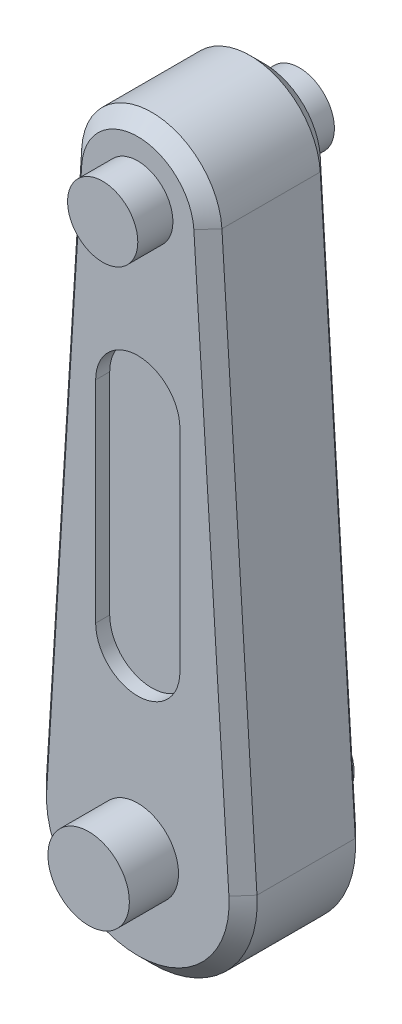
ISO-10303-21;
HEADER;
FILE_DESCRIPTION(('STEP AP214'),'2;1');
FILE_NAME('part.step','',(''),(''),'','','');
FILE_SCHEMA(('AUTOMOTIVE_DESIGN { 1 0 10303 214 1 1 1 1 }'));
ENDSEC;
DATA;
#1=APPLICATION_CONTEXT('core data for automotive mechanical design processes');
#2=APPLICATION_PROTOCOL_DEFINITION('international standard','automotive_design',2000,#1);
#3=PRODUCT_CONTEXT('',#1,'mechanical');
#4=PRODUCT('Part','Part','',(#3));
#5=PRODUCT_RELATED_PRODUCT_CATEGORY('part','',(#4));
#6=PRODUCT_DEFINITION_FORMATION('','',#4);
#7=PRODUCT_DEFINITION_CONTEXT('part definition',#1,'design');
#8=PRODUCT_DEFINITION('design','',#6,#7);
#9=PRODUCT_DEFINITION_SHAPE('','',#8);
#10=(LENGTH_UNIT() NAMED_UNIT(*) SI_UNIT(.MILLI.,.METRE.));
#11=(NAMED_UNIT(*) PLANE_ANGLE_UNIT() SI_UNIT($,.RADIAN.));
#12=(NAMED_UNIT(*) SI_UNIT($,.STERADIAN.) SOLID_ANGLE_UNIT());
#13=UNCERTAINTY_MEASURE_WITH_UNIT(LENGTH_MEASURE(1.E-05),#10,'distance_accuracy_value','');
#14=(GEOMETRIC_REPRESENTATION_CONTEXT(3) GLOBAL_UNCERTAINTY_ASSIGNED_CONTEXT((#13)) GLOBAL_UNIT_ASSIGNED_CONTEXT((#10,
#11,#12)) REPRESENTATION_CONTEXT('',''));
#15=CARTESIAN_POINT('',(0.,0.,0.));
#16=DIRECTION('',(0.,0.,1.));
#17=DIRECTION('',(1.,0.,0.));
#18=AXIS2_PLACEMENT_3D('',#15,#16,#17);
#19=CARTESIAN_POINT('',(0.,0.,-45.));
#20=DIRECTION('',(0.,0.,1.));
#21=DIRECTION('',(1.,0.,0.));
#22=AXIS2_PLACEMENT_3D('',#19,#20,#21);
#23=PLANE('',#22);
#24=CARTESIAN_POINT('',(0.,0.,-45.));
#25=DIRECTION('',(0.,0.,1.));
#26=DIRECTION('',(1.,0.,0.));
#27=AXIS2_PLACEMENT_3D('',#24,#25,#26);
#28=CIRCLE('',#27,29.);
#29=CARTESIAN_POINT('',(29.,0.,-45.));
#30=VERTEX_POINT('',#29);
#31=EDGE_CURVE('E248',#30,#30,#28,.F.);
#32=ORIENTED_EDGE('',*,*,#31,.F.);
#33=EDGE_LOOP('',(#32));
#34=FACE_BOUND('',#33,.T.);
#35=CARTESIAN_POINT('',(0.,400.,-45.));
#36=DIRECTION('',(0.,0.,1.));
#37=DIRECTION('',(1.,0.,0.));
#38=AXIS2_PLACEMENT_3D('',#35,#36,#37);
#39=CIRCLE('',#38,25.);
#40=CARTESIAN_POINT('',(25.,400.,-45.));
#41=VERTEX_POINT('',#40);
#42=EDGE_CURVE('E260',#41,#41,#39,.F.);
#43=ORIENTED_EDGE('',*,*,#42,.F.);
#44=EDGE_LOOP('',(#43));
#45=FACE_BOUND('',#44,.T.);
#46=CARTESIAN_POINT('',(0.,0.,-45.));
#47=DIRECTION('',(0.,0.,1.));
#48=DIRECTION('',(1.,0.,0.));
#49=AXIS2_PLACEMENT_3D('',#46,#47,#48);
#50=CIRCLE('',#49,65.);
#51=CARTESIAN_POINT('',(64.8729226546022,4.0625,-45.));
#52=VERTEX_POINT('',#51);
#53=CARTESIAN_POINT('',(-64.8729226546022,4.0625,-45.));
#54=VERTEX_POINT('',#53);
#55=EDGE_CURVE('E51',#52,#54,#50,.F.);
#56=ORIENTED_EDGE('',*,*,#55,.T.);
#57=DIRECTION('',(0.0625,0.998044963916957,0.));
#58=VECTOR('',#57,1.);
#59=CARTESIAN_POINT('',(-64.8729226546022,4.0625,-45.));
#60=LINE('',#59,#58);
#61=CARTESIAN_POINT('',(-39.9217985566783,402.5,-45.));
#62=VERTEX_POINT('',#61);
#63=EDGE_CURVE('E11',#54,#62,#60,.T.);
#64=ORIENTED_EDGE('',*,*,#63,.T.);
#65=CARTESIAN_POINT('',(0.,400.,-45.));
#66=DIRECTION('',(0.,0.,1.));
#67=DIRECTION('',(1.,0.,0.));
#68=AXIS2_PLACEMENT_3D('',#65,#66,#67);
#69=CIRCLE('',#68,40.);
#70=CARTESIAN_POINT('',(39.9217985566783,402.5,-45.));
#71=VERTEX_POINT('',#70);
#72=EDGE_CURVE('E292',#62,#71,#69,.F.);
#73=ORIENTED_EDGE('',*,*,#72,.T.);
#74=DIRECTION('',(0.0625,-0.998044963916957,0.));
#75=VECTOR('',#74,1.);
#76=CARTESIAN_POINT('',(64.8729226546022,4.0625,-45.));
#77=LINE('',#76,#75);
#78=EDGE_CURVE('E290',#71,#52,#77,.T.);
#79=ORIENTED_EDGE('',*,*,#78,.T.);
#80=EDGE_LOOP('',(#56,#64,#73,#79));
#81=FACE_BOUND('',#80,.T.);
#82=CARTESIAN_POINT('',(0.,275.,-45.));
#83=DIRECTION('',(0.,0.,1.));
#84=DIRECTION('',(1.,0.,0.));
#85=AXIS2_PLACEMENT_3D('',#82,#83,#84);
#86=CIRCLE('',#85,30.);
#87=CARTESIAN_POINT('',(30.,275.,-45.));
#88=VERTEX_POINT('',#87);
#89=CARTESIAN_POINT('',(-30.,275.,-45.));
#90=VERTEX_POINT('',#89);
#91=EDGE_CURVE('E59',#88,#90,#86,.T.);
#92=ORIENTED_EDGE('',*,*,#91,.T.);
#93=DIRECTION('',(0.,-1.,0.));
#94=VECTOR('',#93,1.);
#95=CARTESIAN_POINT('',(-30.,275.,-45.));
#96=LINE('',#95,#94);
#97=CARTESIAN_POINT('',(-30.,125.,-45.));
#98=VERTEX_POINT('',#97);
#99=EDGE_CURVE('E177',#90,#98,#96,.T.);
#100=ORIENTED_EDGE('',*,*,#99,.T.);
#101=CARTESIAN_POINT('',(0.,125.,-45.));
#102=DIRECTION('',(0.,0.,1.));
#103=DIRECTION('',(1.,0.,0.));
#104=AXIS2_PLACEMENT_3D('',#101,#102,#103);
#105=CIRCLE('',#104,30.);
#106=CARTESIAN_POINT('',(30.,125.,-45.));
#107=VERTEX_POINT('',#106);
#108=EDGE_CURVE('E180',#98,#107,#105,.T.);
#109=ORIENTED_EDGE('',*,*,#108,.T.);
#110=DIRECTION('',(0.,1.,0.));
#111=VECTOR('',#110,1.);
#112=CARTESIAN_POINT('',(30.,275.,-45.));
#113=LINE('',#112,#111);
#114=EDGE_CURVE('E186',#107,#88,#113,.T.);
#115=ORIENTED_EDGE('',*,*,#114,.T.);
#116=EDGE_LOOP('',(#92,#100,#109,#115));
#117=FACE_BOUND('',#116,.T.);
#118=ADVANCED_FACE('F41',(#34,#45,#81,#117),#23,.F.);
#119=CARTESIAN_POINT('',(0.,0.,-162.02438661764));
#120=DIRECTION('',(0.,0.,1.));
#121=DIRECTION('',(1.,0.,0.));
#122=AXIS2_PLACEMENT_3D('',#119,#120,#121);
#123=CYLINDRICAL_SURFACE('',#122,29.);
#124=CARTESIAN_POINT('',(0.,0.,45.));
#125=DIRECTION('',(0.,0.,1.));
#126=DIRECTION('',(1.,0.,0.));
#127=AXIS2_PLACEMENT_3D('',#124,#125,#126);
#128=CIRCLE('',#127,29.);
#129=CARTESIAN_POINT('',(29.,0.,45.));
#130=VERTEX_POINT('',#129);
#131=EDGE_CURVE('E255',#130,#130,#128,.F.);
#132=ORIENTED_EDGE('',*,*,#131,.F.);
#133=EDGE_LOOP('',(#132));
#134=FACE_BOUND('',#133,.T.);
#135=CARTESIAN_POINT('',(0.,0.,80.));
#136=DIRECTION('',(0.,0.,1.));
#137=DIRECTION('',(1.,0.,0.));
#138=AXIS2_PLACEMENT_3D('',#135,#136,#137);
#139=CIRCLE('',#138,29.);
#140=CARTESIAN_POINT('',(29.,0.,80.));
#141=VERTEX_POINT('',#140);
#142=EDGE_CURVE('E249',#141,#141,#139,.T.);
#143=ORIENTED_EDGE('',*,*,#142,.F.);
#144=EDGE_LOOP('',(#143));
#145=FACE_BOUND('',#144,.T.);
#146=ADVANCED_FACE('F373',(#134,#145),#123,.T.);
#147=CARTESIAN_POINT('',(0.,0.,80.));
#148=DIRECTION('',(0.,0.,1.));
#149=DIRECTION('',(1.,0.,0.));
#150=AXIS2_PLACEMENT_3D('',#147,#148,#149);
#151=PLANE('',#150);
#152=ORIENTED_EDGE('',*,*,#142,.T.);
#153=EDGE_LOOP('',(#152));
#154=FACE_BOUND('',#153,.T.);
#155=ADVANCED_FACE('F376',(#154),#151,.T.);
#156=CARTESIAN_POINT('',(0.,0.,45.));
#157=DIRECTION('',(0.,0.,-1.));
#158=DIRECTION('',(-1.,0.,0.));
#159=AXIS2_PLACEMENT_3D('',#156,#157,#158);
#160=CYLINDRICAL_SURFACE('',#159,75.);
#161=DIRECTION('',(0.,0.,-1.));
#162=VECTOR('',#161,1.);
#163=CARTESIAN_POINT('',(74.8533722937718,4.6875,45.));
#164=LINE('',#163,#162);
#165=CARTESIAN_POINT('',(74.8533722937718,4.6875,34.9999999999999));
#166=VERTEX_POINT('',#165);
#167=CARTESIAN_POINT('',(74.8533722937718,4.6875,-35.0000000000001));
#168=VERTEX_POINT('',#167);
#169=EDGE_CURVE('E245',#166,#168,#164,.T.);
#170=ORIENTED_EDGE('',*,*,#169,.F.);
#171=CARTESIAN_POINT('',(0.,0.,34.9999999999999));
#172=DIRECTION('',(0.,0.,1.));
#173=DIRECTION('',(1.,0.,0.));
#174=AXIS2_PLACEMENT_3D('',#171,#172,#173);
#175=CIRCLE('',#174,75.);
#176=CARTESIAN_POINT('',(-74.8533722937718,4.68749999999999,34.9999999999999));
#177=VERTEX_POINT('',#176);
#178=EDGE_CURVE('E280',#166,#177,#175,.F.);
#179=ORIENTED_EDGE('',*,*,#178,.T.);
#180=DIRECTION('',(0.,0.,-1.));
#181=VECTOR('',#180,1.);
#182=CARTESIAN_POINT('',(-74.8533722937718,4.68749999999999,45.));
#183=LINE('',#182,#181);
#184=CARTESIAN_POINT('',(-74.8533722937718,4.68749999999999,-35.0000000000001));
#185=VERTEX_POINT('',#184);
#186=EDGE_CURVE('E236',#177,#185,#183,.T.);
#187=ORIENTED_EDGE('',*,*,#186,.T.);
#188=CARTESIAN_POINT('',(0.,0.,-35.0000000000001));
#189=DIRECTION('',(0.,0.,1.));
#190=DIRECTION('',(1.,0.,0.));
#191=AXIS2_PLACEMENT_3D('',#188,#189,#190);
#192=CIRCLE('',#191,75.);
#193=EDGE_CURVE('E278',#185,#168,#192,.T.);
#194=ORIENTED_EDGE('',*,*,#193,.T.);
#195=EDGE_LOOP('',(#170,#179,#187,#194));
#196=FACE_BOUND('',#195,.T.);
#197=ADVANCED_FACE('F337',(#196),#160,.T.);
#198=CARTESIAN_POINT('',(49.9022481958478,403.125,45.));
#199=DIRECTION('',(-0.998044963916957,-0.0625,0.));
#200=DIRECTION('',(0.0625,-0.998044963916957,0.));
#201=AXIS2_PLACEMENT_3D('',#198,#199,#200);
#202=PLANE('',#201);
#203=DIRECTION('',(0.,0.,-1.));
#204=VECTOR('',#203,1.);
#205=CARTESIAN_POINT('',(49.9022481958479,403.125,45.));
#206=LINE('',#205,#204);
#207=CARTESIAN_POINT('',(49.9022481958479,403.125,34.9999999999999));
#208=VERTEX_POINT('',#207);
#209=CARTESIAN_POINT('',(49.9022481958479,403.125,-35.0000000000001));
#210=VERTEX_POINT('',#209);
#211=EDGE_CURVE('E242',#208,#210,#206,.T.);
#212=ORIENTED_EDGE('',*,*,#211,.F.);
#213=DIRECTION('',(0.0625,-0.998044963916957,0.));
#214=VECTOR('',#213,1.);
#215=CARTESIAN_POINT('',(74.8533722937718,4.6875,34.9999999999999));
#216=LINE('',#215,#214);
#217=EDGE_CURVE('E288',#208,#166,#216,.T.);
#218=ORIENTED_EDGE('',*,*,#217,.T.);
#219=ORIENTED_EDGE('',*,*,#169,.T.);
#220=DIRECTION('',(-0.0625,0.998044963916957,0.));
#221=VECTOR('',#220,1.);
#222=CARTESIAN_POINT('',(49.9022481958478,403.125,-35.0000000000001));
#223=LINE('',#222,#221);
#224=EDGE_CURVE('E286',#168,#210,#223,.T.);
#225=ORIENTED_EDGE('',*,*,#224,.T.);
#226=EDGE_LOOP('',(#212,#218,#219,#225));
#227=FACE_BOUND('',#226,.T.);
#228=ADVANCED_FACE('F354',(#227),#202,.F.);
#229=CARTESIAN_POINT('',(0.,400.,45.));
#230=DIRECTION('',(0.,0.,-1.));
#231=DIRECTION('',(-1.,0.,0.));
#232=AXIS2_PLACEMENT_3D('',#229,#230,#231);
#233=CYLINDRICAL_SURFACE('',#232,50.);
#234=DIRECTION('',(0.,0.,-1.));
#235=VECTOR('',#234,1.);
#236=CARTESIAN_POINT('',(-49.9022481958479,403.125,45.));
#237=LINE('',#236,#235);
#238=CARTESIAN_POINT('',(-49.9022481958479,403.125,34.9999999999999));
#239=VERTEX_POINT('',#238);
#240=CARTESIAN_POINT('',(-49.9022481958479,403.125,-35.0000000000001));
#241=VERTEX_POINT('',#240);
#242=EDGE_CURVE('E239',#239,#241,#237,.T.);
#243=ORIENTED_EDGE('',*,*,#242,.F.);
#244=CARTESIAN_POINT('',(0.,400.,34.9999999999999));
#245=DIRECTION('',(0.,0.,1.));
#246=DIRECTION('',(1.,0.,0.));
#247=AXIS2_PLACEMENT_3D('',#244,#245,#246);
#248=CIRCLE('',#247,50.);
#249=EDGE_CURVE('E284',#239,#208,#248,.F.);
#250=ORIENTED_EDGE('',*,*,#249,.T.);
#251=ORIENTED_EDGE('',*,*,#211,.T.);
#252=CARTESIAN_POINT('',(0.,400.,-35.0000000000001));
#253=DIRECTION('',(0.,0.,1.));
#254=DIRECTION('',(1.,0.,0.));
#255=AXIS2_PLACEMENT_3D('',#252,#253,#254);
#256=CIRCLE('',#255,50.);
#257=EDGE_CURVE('E282',#210,#241,#256,.T.);
#258=ORIENTED_EDGE('',*,*,#257,.T.);
#259=EDGE_LOOP('',(#243,#250,#251,#258));
#260=FACE_BOUND('',#259,.T.);
#261=ADVANCED_FACE('F350',(#260),#233,.T.);
#262=CARTESIAN_POINT('',(-74.8533722937718,4.68749999999999,45.));
#263=DIRECTION('',(0.998044963916957,-0.0625,0.));
#264=DIRECTION('',(0.0625,0.998044963916957,0.));
#265=AXIS2_PLACEMENT_3D('',#262,#263,#264);
#266=PLANE('',#265);
#267=ORIENTED_EDGE('',*,*,#186,.F.);
#268=DIRECTION('',(0.0625,0.998044963916957,0.));
#269=VECTOR('',#268,1.);
#270=CARTESIAN_POINT('',(-49.9022481958479,403.125,34.9999999999999));
#271=LINE('',#270,#269);
#272=EDGE_CURVE('E275',#177,#239,#271,.T.);
#273=ORIENTED_EDGE('',*,*,#272,.T.);
#274=ORIENTED_EDGE('',*,*,#242,.T.);
#275=DIRECTION('',(-0.0625,-0.998044963916957,0.));
#276=VECTOR('',#275,1.);
#277=CARTESIAN_POINT('',(-74.8533722937718,4.68749999999999,-35.0000000000001));
#278=LINE('',#277,#276);
#279=EDGE_CURVE('E272',#241,#185,#278,.T.);
#280=ORIENTED_EDGE('',*,*,#279,.T.);
#281=EDGE_LOOP('',(#267,#273,#274,#280));
#282=FACE_BOUND('',#281,.T.);
#283=ADVANCED_FACE('F334',(#282),#266,.F.);
#284=CARTESIAN_POINT('',(0.,0.,45.));
#285=DIRECTION('',(0.,0.,1.));
#286=DIRECTION('',(1.,0.,0.));
#287=AXIS2_PLACEMENT_3D('',#284,#285,#286);
#288=PLANE('',#287);
#289=CARTESIAN_POINT('',(0.,275.,45.));
#290=DIRECTION('',(0.,0.,1.));
#291=DIRECTION('',(1.,0.,0.));
#292=AXIS2_PLACEMENT_3D('',#289,#290,#291);
#293=CIRCLE('',#292,30.);
#294=CARTESIAN_POINT('',(30.,275.,45.));
#295=VERTEX_POINT('',#294);
#296=CARTESIAN_POINT('',(-30.,275.,45.));
#297=VERTEX_POINT('',#296);
#298=EDGE_CURVE('E67',#295,#297,#293,.T.);
#299=ORIENTED_EDGE('',*,*,#298,.F.);
#300=DIRECTION('',(0.,1.,0.));
#301=VECTOR('',#300,1.);
#302=CARTESIAN_POINT('',(30.,275.,45.));
#303=LINE('',#302,#301);
#304=CARTESIAN_POINT('',(30.,125.,45.));
#305=VERTEX_POINT('',#304);
#306=EDGE_CURVE('E199',#305,#295,#303,.T.);
#307=ORIENTED_EDGE('',*,*,#306,.F.);
#308=CARTESIAN_POINT('',(0.,125.,45.));
#309=DIRECTION('',(0.,0.,1.));
#310=DIRECTION('',(1.,0.,0.));
#311=AXIS2_PLACEMENT_3D('',#308,#309,#310);
#312=CIRCLE('',#311,30.);
#313=CARTESIAN_POINT('',(-30.,125.,45.));
#314=VERTEX_POINT('',#313);
#315=EDGE_CURVE('E213',#314,#305,#312,.T.);
#316=ORIENTED_EDGE('',*,*,#315,.F.);
#317=DIRECTION('',(0.,-1.,0.));
#318=VECTOR('',#317,1.);
#319=CARTESIAN_POINT('',(-30.,275.,45.));
#320=LINE('',#319,#318);
#321=EDGE_CURVE('E210',#297,#314,#320,.T.);
#322=ORIENTED_EDGE('',*,*,#321,.F.);
#323=EDGE_LOOP('',(#299,#307,#316,#322));
#324=FACE_BOUND('',#323,.T.);
#325=CARTESIAN_POINT('',(0.,400.,45.));
#326=DIRECTION('',(0.,0.,1.));
#327=DIRECTION('',(1.,0.,0.));
#328=AXIS2_PLACEMENT_3D('',#325,#326,#327);
#329=CIRCLE('',#328,40.);
#330=CARTESIAN_POINT('',(39.9217985566782,402.5,45.));
#331=VERTEX_POINT('',#330);
#332=CARTESIAN_POINT('',(-39.9217985566782,402.5,45.));
#333=VERTEX_POINT('',#332);
#334=EDGE_CURVE('E265',#331,#333,#329,.T.);
#335=ORIENTED_EDGE('',*,*,#334,.T.);
#336=DIRECTION('',(-0.0625,-0.998044963916957,0.));
#337=VECTOR('',#336,1.);
#338=CARTESIAN_POINT('',(-64.8729226546022,4.06249999999999,45.));
#339=LINE('',#338,#337);
#340=CARTESIAN_POINT('',(-64.8729226546022,4.06249999999999,45.));
#341=VERTEX_POINT('',#340);
#342=EDGE_CURVE('E269',#333,#341,#339,.T.);
#343=ORIENTED_EDGE('',*,*,#342,.T.);
#344=CARTESIAN_POINT('',(0.,0.,45.));
#345=DIRECTION('',(0.,0.,1.));
#346=DIRECTION('',(1.,0.,0.));
#347=AXIS2_PLACEMENT_3D('',#344,#345,#346);
#348=CIRCLE('',#347,65.);
#349=CARTESIAN_POINT('',(64.8729226546022,4.0625,45.));
#350=VERTEX_POINT('',#349);
#351=EDGE_CURVE('E267',#341,#350,#348,.T.);
#352=ORIENTED_EDGE('',*,*,#351,.T.);
#353=DIRECTION('',(-0.0625,0.998044963916957,0.));
#354=VECTOR('',#353,1.);
#355=CARTESIAN_POINT('',(39.9217985566782,402.5,45.));
#356=LINE('',#355,#354);
#357=EDGE_CURVE('E263',#350,#331,#356,.T.);
#358=ORIENTED_EDGE('',*,*,#357,.T.);
#359=EDGE_LOOP('',(#335,#343,#352,#358));
#360=FACE_BOUND('',#359,.T.);
#361=CARTESIAN_POINT('',(0.,400.,45.));
#362=DIRECTION('',(0.,0.,1.));
#363=DIRECTION('',(1.,0.,0.));
#364=AXIS2_PLACEMENT_3D('',#361,#362,#363);
#365=CIRCLE('',#364,25.);
#366=CARTESIAN_POINT('',(25.,400.,45.));
#367=VERTEX_POINT('',#366);
#368=EDGE_CURVE('E229',#367,#367,#365,.F.);
#369=ORIENTED_EDGE('',*,*,#368,.T.);
#370=EDGE_LOOP('',(#369));
#371=FACE_BOUND('',#370,.T.);
#372=ORIENTED_EDGE('',*,*,#131,.T.);
#373=EDGE_LOOP('',(#372));
#374=FACE_BOUND('',#373,.T.);
#375=ADVANCED_FACE('F363',(#324,#360,#371,#374),#288,.T.);
#376=CARTESIAN_POINT('',(-115.,-165.,-80.));
#377=DIRECTION('',(0.,0.,1.));
#378=DIRECTION('',(1.,0.,0.));
#379=AXIS2_PLACEMENT_3D('',#376,#377,#378);
#380=PLANE('',#379);
#381=CARTESIAN_POINT('',(0.,0.,-80.));
#382=DIRECTION('',(0.,0.,1.));
#383=DIRECTION('',(1.,0.,0.));
#384=AXIS2_PLACEMENT_3D('',#381,#382,#383);
#385=CIRCLE('',#384,29.);
#386=CARTESIAN_POINT('',(29.,0.,-80.));
#387=VERTEX_POINT('',#386);
#388=EDGE_CURVE('E252',#387,#387,#385,.F.);
#389=ORIENTED_EDGE('',*,*,#388,.T.);
#390=EDGE_LOOP('',(#389));
#391=FACE_BOUND('',#390,.T.);
#392=ADVANCED_FACE('F366',(#391),#380,.F.);
#393=ORIENTED_EDGE('',*,*,#388,.F.);
#394=EDGE_LOOP('',(#393));
#395=FACE_BOUND('',#394,.T.);
#396=ORIENTED_EDGE('',*,*,#31,.T.);
#397=EDGE_LOOP('',(#396));
#398=FACE_BOUND('',#397,.T.);
#399=ADVANCED_FACE('F378',(#395,#398),#123,.T.);
#400=CARTESIAN_POINT('',(0.,400.,-70.));
#401=DIRECTION('',(0.,0.,1.));
#402=DIRECTION('',(1.,0.,0.));
#403=AXIS2_PLACEMENT_3D('',#400,#401,#402);
#404=PLANE('',#403);
#405=CARTESIAN_POINT('',(0.,400.,-70.));
#406=DIRECTION('',(0.,0.,1.));
#407=DIRECTION('',(1.,0.,0.));
#408=AXIS2_PLACEMENT_3D('',#405,#406,#407);
#409=CIRCLE('',#408,25.);
#410=CARTESIAN_POINT('',(25.,400.,-70.));
#411=VERTEX_POINT('',#410);
#412=EDGE_CURVE('E230',#411,#411,#409,.T.);
#413=ORIENTED_EDGE('',*,*,#412,.F.);
#414=EDGE_LOOP('',(#413));
#415=FACE_BOUND('',#414,.T.);
#416=ADVANCED_FACE('F407',(#415),#404,.F.);
#417=CARTESIAN_POINT('',(0.,400.,70.));
#418=DIRECTION('',(0.,0.,-1.));
#419=DIRECTION('',(-1.,0.,0.));
#420=AXIS2_PLACEMENT_3D('',#417,#418,#419);
#421=CYLINDRICAL_SURFACE('',#420,25.);
#422=ORIENTED_EDGE('',*,*,#412,.T.);
#423=EDGE_LOOP('',(#422));
#424=FACE_BOUND('',#423,.T.);
#425=ORIENTED_EDGE('',*,*,#42,.T.);
#426=EDGE_LOOP('',(#425));
#427=FACE_BOUND('',#426,.T.);
#428=ADVANCED_FACE('F414',(#424,#427),#421,.T.);
#429=ORIENTED_EDGE('',*,*,#368,.F.);
#430=EDGE_LOOP('',(#429));
#431=FACE_BOUND('',#430,.T.);
#432=CARTESIAN_POINT('',(0.,400.,70.));
#433=DIRECTION('',(0.,0.,1.));
#434=DIRECTION('',(1.,0.,0.));
#435=AXIS2_PLACEMENT_3D('',#432,#433,#434);
#436=CIRCLE('',#435,25.);
#437=CARTESIAN_POINT('',(25.,400.,70.));
#438=VERTEX_POINT('',#437);
#439=EDGE_CURVE('E226',#438,#438,#436,.T.);
#440=ORIENTED_EDGE('',*,*,#439,.F.);
#441=EDGE_LOOP('',(#440));
#442=FACE_BOUND('',#441,.T.);
#443=ADVANCED_FACE('F485',(#431,#442),#421,.T.);
#444=CARTESIAN_POINT('',(0.,400.,70.));
#445=DIRECTION('',(0.,0.,1.));
#446=DIRECTION('',(1.,0.,0.));
#447=AXIS2_PLACEMENT_3D('',#444,#445,#446);
#448=PLANE('',#447);
#449=ORIENTED_EDGE('',*,*,#439,.T.);
#450=EDGE_LOOP('',(#449));
#451=FACE_BOUND('',#450,.T.);
#452=ADVANCED_FACE('F438',(#451),#448,.T.);
#453=CARTESIAN_POINT('',(64.8729226546022,4.0625,45.));
#454=DIRECTION('',(0.705724361914765,0.0441941738241593,0.707106781186546));
#455=DIRECTION('',(0.0625,-0.998044963916957,0.));
#456=AXIS2_PLACEMENT_3D('',#453,#454,#455);
#457=PLANE('',#456);
#458=DIRECTION('',(-0.705724361914762,-0.0441941738241591,0.707106781186549));
#459=VECTOR('',#458,1.);
#460=CARTESIAN_POINT('',(74.8533722937718,4.6875,34.9999999999999));
#461=LINE('',#460,#459);
#462=EDGE_CURVE('E299',#166,#350,#461,.T.);
#463=ORIENTED_EDGE('',*,*,#462,.F.);
#464=ORIENTED_EDGE('',*,*,#217,.F.);
#465=DIRECTION('',(0.705724361914762,0.0441941738241581,-0.707106781186549));
#466=VECTOR('',#465,1.);
#467=CARTESIAN_POINT('',(39.9217985566782,402.5,45.));
#468=LINE('',#467,#466);
#469=EDGE_CURVE('E233',#331,#208,#468,.T.);
#470=ORIENTED_EDGE('',*,*,#469,.F.);
#471=ORIENTED_EDGE('',*,*,#357,.F.);
#472=EDGE_LOOP('',(#463,#464,#470,#471));
#473=FACE_BOUND('',#472,.T.);
#474=ADVANCED_FACE('F357',(#473),#457,.T.);
#475=CARTESIAN_POINT('',(0.,400.,45.));
#476=DIRECTION('',(0.,0.,-1.));
#477=DIRECTION('',(-1.,0.,0.));
#478=AXIS2_PLACEMENT_3D('',#475,#476,#477);
#479=CONICAL_SURFACE('',#478,40.,0.785398163397447);
#480=ORIENTED_EDGE('',*,*,#469,.T.);
#481=ORIENTED_EDGE('',*,*,#249,.F.);
#482=DIRECTION('',(-0.705724361914763,0.0441941738241581,-0.707106781186548));
#483=VECTOR('',#482,1.);
#484=CARTESIAN_POINT('',(-39.9217985566782,402.5,45.));
#485=LINE('',#484,#483);
#486=EDGE_CURVE('E297',#333,#239,#485,.T.);
#487=ORIENTED_EDGE('',*,*,#486,.F.);
#488=ORIENTED_EDGE('',*,*,#334,.F.);
#489=EDGE_LOOP('',(#480,#481,#487,#488));
#490=FACE_BOUND('',#489,.T.);
#491=ADVANCED_FACE('F361',(#490),#479,.T.);
#492=CARTESIAN_POINT('',(0.,0.,45.));
#493=DIRECTION('',(0.,0.,-1.));
#494=DIRECTION('',(-1.,0.,0.));
#495=AXIS2_PLACEMENT_3D('',#492,#493,#494);
#496=CONICAL_SURFACE('',#495,65.,0.785398163397447);
#497=ORIENTED_EDGE('',*,*,#462,.T.);
#498=ORIENTED_EDGE('',*,*,#351,.F.);
#499=DIRECTION('',(0.705724361914763,-0.0441941738241592,0.707106781186548));
#500=VECTOR('',#499,1.);
#501=CARTESIAN_POINT('',(-74.8533722937718,4.68749999999999,34.9999999999999));
#502=LINE('',#501,#500);
#503=EDGE_CURVE('E295',#177,#341,#502,.T.);
#504=ORIENTED_EDGE('',*,*,#503,.F.);
#505=ORIENTED_EDGE('',*,*,#178,.F.);
#506=EDGE_LOOP('',(#497,#498,#504,#505));
#507=FACE_BOUND('',#506,.T.);
#508=ADVANCED_FACE('F342',(#507),#496,.T.);
#509=CARTESIAN_POINT('',(-64.8729226546022,4.0625,45.));
#510=DIRECTION('',(-0.705724361914765,0.0441941738241593,0.707106781186546));
#511=DIRECTION('',(0.0625,0.998044963916957,0.));
#512=AXIS2_PLACEMENT_3D('',#509,#510,#511);
#513=PLANE('',#512);
#514=ORIENTED_EDGE('',*,*,#486,.T.);
#515=ORIENTED_EDGE('',*,*,#272,.F.);
#516=ORIENTED_EDGE('',*,*,#503,.T.);
#517=ORIENTED_EDGE('',*,*,#342,.F.);
#518=EDGE_LOOP('',(#514,#515,#516,#517));
#519=FACE_BOUND('',#518,.T.);
#520=ADVANCED_FACE('F346',(#519),#513,.T.);
#521=CARTESIAN_POINT('',(49.9022481958478,403.125,-35.0000000000001));
#522=DIRECTION('',(-0.705724361914761,-0.0441941738241591,0.70710678118655));
#523=DIRECTION('',(-0.0625,0.998044963916957,0.));
#524=AXIS2_PLACEMENT_3D('',#521,#522,#523);
#525=PLANE('',#524);
#526=DIRECTION('',(0.705724361914766,0.0441941738241594,0.707106781186545));
#527=VECTOR('',#526,1.);
#528=CARTESIAN_POINT('',(64.8729226546022,4.0625,-45.));
#529=LINE('',#528,#527);
#530=EDGE_CURVE('E306',#52,#168,#529,.T.);
#531=ORIENTED_EDGE('',*,*,#530,.F.);
#532=ORIENTED_EDGE('',*,*,#78,.F.);
#533=DIRECTION('',(-0.705724361914766,-0.0441941738241586,-0.707106781186545));
#534=VECTOR('',#533,1.);
#535=CARTESIAN_POINT('',(49.9022481958478,403.125,-35.0000000000001));
#536=LINE('',#535,#534);
#537=EDGE_CURVE('E46',#210,#71,#536,.T.);
#538=ORIENTED_EDGE('',*,*,#537,.F.);
#539=ORIENTED_EDGE('',*,*,#224,.F.);
#540=EDGE_LOOP('',(#531,#532,#538,#539));
#541=FACE_BOUND('',#540,.T.);
#542=ADVANCED_FACE('F44',(#541),#525,.F.);
#543=CARTESIAN_POINT('',(0.,400.,-35.0000000000001));
#544=DIRECTION('',(0.,0.,1.));
#545=DIRECTION('',(1.,0.,0.));
#546=AXIS2_PLACEMENT_3D('',#543,#544,#545);
#547=CONICAL_SURFACE('',#546,50.,0.785398163397452);
#548=ORIENTED_EDGE('',*,*,#537,.T.);
#549=ORIENTED_EDGE('',*,*,#72,.F.);
#550=DIRECTION('',(0.705724361914766,-0.0441941738241586,-0.707106781186545));
#551=VECTOR('',#550,1.);
#552=CARTESIAN_POINT('',(-49.9022481958478,403.125,-35.0000000000001));
#553=LINE('',#552,#551);
#554=EDGE_CURVE('E305',#241,#62,#553,.T.);
#555=ORIENTED_EDGE('',*,*,#554,.F.);
#556=ORIENTED_EDGE('',*,*,#257,.F.);
#557=EDGE_LOOP('',(#548,#549,#555,#556));
#558=FACE_BOUND('',#557,.T.);
#559=ADVANCED_FACE('F317',(#558),#547,.T.);
#560=CARTESIAN_POINT('',(0.,0.,-35.0000000000001));
#561=DIRECTION('',(0.,0.,1.));
#562=DIRECTION('',(1.,0.,0.));
#563=AXIS2_PLACEMENT_3D('',#560,#561,#562);
#564=CONICAL_SURFACE('',#563,75.,0.785398163397452);
#565=ORIENTED_EDGE('',*,*,#530,.T.);
#566=ORIENTED_EDGE('',*,*,#193,.F.);
#567=DIRECTION('',(-0.705724361914765,0.0441941738241593,0.707106781186545));
#568=VECTOR('',#567,1.);
#569=CARTESIAN_POINT('',(-64.8729226546022,4.0625,-45.));
#570=LINE('',#569,#568);
#571=EDGE_CURVE('E220',#54,#185,#570,.T.);
#572=ORIENTED_EDGE('',*,*,#571,.F.);
#573=ORIENTED_EDGE('',*,*,#55,.F.);
#574=EDGE_LOOP('',(#565,#566,#572,#573));
#575=FACE_BOUND('',#574,.T.);
#576=ADVANCED_FACE('F329',(#575),#564,.T.);
#577=CARTESIAN_POINT('',(-74.8533722937718,4.68749999999999,-35.0000000000001));
#578=DIRECTION('',(0.705724361914761,-0.0441941738241591,0.70710678118655));
#579=DIRECTION('',(-0.0625,-0.998044963916957,0.));
#580=AXIS2_PLACEMENT_3D('',#577,#578,#579);
#581=PLANE('',#580);
#582=ORIENTED_EDGE('',*,*,#554,.T.);
#583=ORIENTED_EDGE('',*,*,#63,.F.);
#584=ORIENTED_EDGE('',*,*,#571,.T.);
#585=ORIENTED_EDGE('',*,*,#279,.F.);
#586=EDGE_LOOP('',(#582,#583,#584,#585));
#587=FACE_BOUND('',#586,.T.);
#588=ADVANCED_FACE('F327',(#587),#581,.F.);
#589=CARTESIAN_POINT('',(0.,275.,35.));
#590=DIRECTION('',(0.,0.,1.));
#591=DIRECTION('',(1.,0.,0.));
#592=AXIS2_PLACEMENT_3D('',#589,#590,#591);
#593=CYLINDRICAL_SURFACE('',#592,30.);
#594=ORIENTED_EDGE('',*,*,#298,.T.);
#595=DIRECTION('',(0.,0.,1.));
#596=VECTOR('',#595,1.);
#597=CARTESIAN_POINT('',(-30.,275.,35.));
#598=LINE('',#597,#596);
#599=CARTESIAN_POINT('',(-30.,275.,35.));
#600=VERTEX_POINT('',#599);
#601=EDGE_CURVE('E208',#600,#297,#598,.T.);
#602=ORIENTED_EDGE('',*,*,#601,.F.);
#603=CARTESIAN_POINT('',(0.,275.,35.));
#604=DIRECTION('',(0.,0.,1.));
#605=DIRECTION('',(1.,0.,0.));
#606=AXIS2_PLACEMENT_3D('',#603,#604,#605);
#607=CIRCLE('',#606,30.);
#608=CARTESIAN_POINT('',(30.,275.,35.));
#609=VERTEX_POINT('',#608);
#610=EDGE_CURVE('E195',#609,#600,#607,.T.);
#611=ORIENTED_EDGE('',*,*,#610,.F.);
#612=DIRECTION('',(0.,0.,1.));
#613=VECTOR('',#612,1.);
#614=CARTESIAN_POINT('',(30.,275.,35.));
#615=LINE('',#614,#613);
#616=EDGE_CURVE('E218',#609,#295,#615,.T.);
#617=ORIENTED_EDGE('',*,*,#616,.T.);
#618=EDGE_LOOP('',(#594,#602,#611,#617));
#619=FACE_BOUND('',#618,.T.);
#620=ADVANCED_FACE('F445',(#619),#593,.F.);
#621=CARTESIAN_POINT('',(30.,275.,35.));
#622=DIRECTION('',(1.,0.,0.));
#623=DIRECTION('',(0.,1.,0.));
#624=AXIS2_PLACEMENT_3D('',#621,#622,#623);
#625=PLANE('',#624);
#626=ORIENTED_EDGE('',*,*,#306,.T.);
#627=ORIENTED_EDGE('',*,*,#616,.F.);
#628=DIRECTION('',(0.,1.,0.));
#629=VECTOR('',#628,1.);
#630=CARTESIAN_POINT('',(30.,275.,35.));
#631=LINE('',#630,#629);
#632=CARTESIAN_POINT('',(30.,125.,35.));
#633=VERTEX_POINT('',#632);
#634=EDGE_CURVE('E205',#633,#609,#631,.T.);
#635=ORIENTED_EDGE('',*,*,#634,.F.);
#636=DIRECTION('',(0.,0.,1.));
#637=VECTOR('',#636,1.);
#638=CARTESIAN_POINT('',(30.,125.,35.));
#639=LINE('',#638,#637);
#640=EDGE_CURVE('E221',#633,#305,#639,.T.);
#641=ORIENTED_EDGE('',*,*,#640,.T.);
#642=EDGE_LOOP('',(#626,#627,#635,#641));
#643=FACE_BOUND('',#642,.T.);
#644=ADVANCED_FACE('F589',(#643),#625,.F.);
#645=CARTESIAN_POINT('',(0.,125.,35.));
#646=DIRECTION('',(0.,0.,1.));
#647=DIRECTION('',(1.,0.,0.));
#648=AXIS2_PLACEMENT_3D('',#645,#646,#647);
#649=CYLINDRICAL_SURFACE('',#648,30.);
#650=ORIENTED_EDGE('',*,*,#315,.T.);
#651=ORIENTED_EDGE('',*,*,#640,.F.);
#652=CARTESIAN_POINT('',(0.,125.,35.));
#653=DIRECTION('',(0.,0.,1.));
#654=DIRECTION('',(1.,0.,0.));
#655=AXIS2_PLACEMENT_3D('',#652,#653,#654);
#656=CIRCLE('',#655,30.);
#657=CARTESIAN_POINT('',(-30.,125.,35.));
#658=VERTEX_POINT('',#657);
#659=EDGE_CURVE('E202',#658,#633,#656,.T.);
#660=ORIENTED_EDGE('',*,*,#659,.F.);
#661=DIRECTION('',(0.,0.,1.));
#662=VECTOR('',#661,1.);
#663=CARTESIAN_POINT('',(-30.,125.,35.));
#664=LINE('',#663,#662);
#665=EDGE_CURVE('E223',#658,#314,#664,.T.);
#666=ORIENTED_EDGE('',*,*,#665,.T.);
#667=EDGE_LOOP('',(#650,#651,#660,#666));
#668=FACE_BOUND('',#667,.T.);
#669=ADVANCED_FACE('F597',(#668),#649,.F.);
#670=CARTESIAN_POINT('',(-30.,275.,35.));
#671=DIRECTION('',(-1.,0.,0.));
#672=DIRECTION('',(0.,-1.,0.));
#673=AXIS2_PLACEMENT_3D('',#670,#671,#672);
#674=PLANE('',#673);
#675=ORIENTED_EDGE('',*,*,#321,.T.);
#676=ORIENTED_EDGE('',*,*,#665,.F.);
#677=DIRECTION('',(0.,-1.,0.));
#678=VECTOR('',#677,1.);
#679=CARTESIAN_POINT('',(-30.,275.,35.));
#680=LINE('',#679,#678);
#681=EDGE_CURVE('E198',#600,#658,#680,.T.);
#682=ORIENTED_EDGE('',*,*,#681,.F.);
#683=ORIENTED_EDGE('',*,*,#601,.T.);
#684=EDGE_LOOP('',(#675,#676,#682,#683));
#685=FACE_BOUND('',#684,.T.);
#686=ADVANCED_FACE('F606',(#685),#674,.F.);
#687=CARTESIAN_POINT('',(0.,275.,35.));
#688=DIRECTION('',(0.,0.,1.));
#689=DIRECTION('',(1.,0.,0.));
#690=AXIS2_PLACEMENT_3D('',#687,#688,#689);
#691=PLANE('',#690);
#692=ORIENTED_EDGE('',*,*,#610,.T.);
#693=ORIENTED_EDGE('',*,*,#681,.T.);
#694=ORIENTED_EDGE('',*,*,#659,.T.);
#695=ORIENTED_EDGE('',*,*,#634,.T.);
#696=EDGE_LOOP('',(#692,#693,#694,#695));
#697=FACE_BOUND('',#696,.T.);
#698=ADVANCED_FACE('F615',(#697),#691,.T.);
#699=CARTESIAN_POINT('',(0.,275.,-35.));
#700=DIRECTION('',(0.,0.,-1.));
#701=DIRECTION('',(-1.,0.,0.));
#702=AXIS2_PLACEMENT_3D('',#699,#700,#701);
#703=CYLINDRICAL_SURFACE('',#702,30.);
#704=ORIENTED_EDGE('',*,*,#91,.F.);
#705=DIRECTION('',(0.,0.,-1.));
#706=VECTOR('',#705,1.);
#707=CARTESIAN_POINT('',(30.,275.,-35.));
#708=LINE('',#707,#706);
#709=CARTESIAN_POINT('',(30.,275.,-35.));
#710=VERTEX_POINT('',#709);
#711=EDGE_CURVE('E162',#710,#88,#708,.T.);
#712=ORIENTED_EDGE('',*,*,#711,.F.);
#713=CARTESIAN_POINT('',(0.,275.,-35.));
#714=DIRECTION('',(0.,0.,1.));
#715=DIRECTION('',(1.,0.,0.));
#716=AXIS2_PLACEMENT_3D('',#713,#714,#715);
#717=CIRCLE('',#716,30.);
#718=CARTESIAN_POINT('',(-30.,275.,-35.));
#719=VERTEX_POINT('',#718);
#720=EDGE_CURVE('E169',#710,#719,#717,.T.);
#721=ORIENTED_EDGE('',*,*,#720,.T.);
#722=DIRECTION('',(0.,0.,-1.));
#723=VECTOR('',#722,1.);
#724=CARTESIAN_POINT('',(-30.,275.,-35.));
#725=LINE('',#724,#723);
#726=EDGE_CURVE('E190',#719,#90,#725,.T.);
#727=ORIENTED_EDGE('',*,*,#726,.T.);
#728=EDGE_LOOP('',(#704,#712,#721,#727));
#729=FACE_BOUND('',#728,.T.);
#730=ADVANCED_FACE('F172',(#729),#703,.F.);
#731=CARTESIAN_POINT('',(-30.,275.,-35.));
#732=DIRECTION('',(1.,0.,0.));
#733=DIRECTION('',(0.,1.,0.));
#734=AXIS2_PLACEMENT_3D('',#731,#732,#733);
#735=PLANE('',#734);
#736=ORIENTED_EDGE('',*,*,#99,.F.);
#737=ORIENTED_EDGE('',*,*,#726,.F.);
#738=DIRECTION('',(0.,-1.,0.));
#739=VECTOR('',#738,1.);
#740=CARTESIAN_POINT('',(-30.,275.,-35.));
#741=LINE('',#740,#739);
#742=CARTESIAN_POINT('',(-30.,125.,-35.));
#743=VERTEX_POINT('',#742);
#744=EDGE_CURVE('E174',#719,#743,#741,.T.);
#745=ORIENTED_EDGE('',*,*,#744,.T.);
#746=DIRECTION('',(0.,0.,-1.));
#747=VECTOR('',#746,1.);
#748=CARTESIAN_POINT('',(-30.,125.,-35.));
#749=LINE('',#748,#747);
#750=EDGE_CURVE('E192',#743,#98,#749,.T.);
#751=ORIENTED_EDGE('',*,*,#750,.T.);
#752=EDGE_LOOP('',(#736,#737,#745,#751));
#753=FACE_BOUND('',#752,.T.);
#754=ADVANCED_FACE('F632',(#753),#735,.T.);
#755=CARTESIAN_POINT('',(0.,125.,-35.));
#756=DIRECTION('',(0.,0.,-1.));
#757=DIRECTION('',(-1.,0.,0.));
#758=AXIS2_PLACEMENT_3D('',#755,#756,#757);
#759=CYLINDRICAL_SURFACE('',#758,30.);
#760=ORIENTED_EDGE('',*,*,#108,.F.);
#761=ORIENTED_EDGE('',*,*,#750,.F.);
#762=CARTESIAN_POINT('',(0.,125.,-35.));
#763=DIRECTION('',(0.,0.,1.));
#764=DIRECTION('',(1.,0.,0.));
#765=AXIS2_PLACEMENT_3D('',#762,#763,#764);
#766=CIRCLE('',#765,30.);
#767=CARTESIAN_POINT('',(30.,125.,-35.));
#768=VERTEX_POINT('',#767);
#769=EDGE_CURVE('E168',#743,#768,#766,.T.);
#770=ORIENTED_EDGE('',*,*,#769,.T.);
#771=DIRECTION('',(0.,0.,-1.));
#772=VECTOR('',#771,1.);
#773=CARTESIAN_POINT('',(30.,125.,-35.));
#774=LINE('',#773,#772);
#775=EDGE_CURVE('E164',#768,#107,#774,.T.);
#776=ORIENTED_EDGE('',*,*,#775,.T.);
#777=EDGE_LOOP('',(#760,#761,#770,#776));
#778=FACE_BOUND('',#777,.T.);
#779=ADVANCED_FACE('F640',(#778),#759,.F.);
#780=CARTESIAN_POINT('',(30.,275.,-35.));
#781=DIRECTION('',(-1.,0.,0.));
#782=DIRECTION('',(0.,-1.,0.));
#783=AXIS2_PLACEMENT_3D('',#780,#781,#782);
#784=PLANE('',#783);
#785=ORIENTED_EDGE('',*,*,#114,.F.);
#786=ORIENTED_EDGE('',*,*,#775,.F.);
#787=DIRECTION('',(0.,1.,0.));
#788=VECTOR('',#787,1.);
#789=CARTESIAN_POINT('',(30.,275.,-35.));
#790=LINE('',#789,#788);
#791=EDGE_CURVE('E159',#768,#710,#790,.T.);
#792=ORIENTED_EDGE('',*,*,#791,.T.);
#793=ORIENTED_EDGE('',*,*,#711,.T.);
#794=EDGE_LOOP('',(#785,#786,#792,#793));
#795=FACE_BOUND('',#794,.T.);
#796=ADVANCED_FACE('F161',(#795),#784,.T.);
#797=CARTESIAN_POINT('',(0.,275.,-35.));
#798=DIRECTION('',(0.,0.,-1.));
#799=DIRECTION('',(1.,0.,0.));
#800=AXIS2_PLACEMENT_3D('',#797,#798,#799);
#801=PLANE('',#800);
#802=ORIENTED_EDGE('',*,*,#720,.F.);
#803=ORIENTED_EDGE('',*,*,#791,.F.);
#804=ORIENTED_EDGE('',*,*,#769,.F.);
#805=ORIENTED_EDGE('',*,*,#744,.F.);
#806=EDGE_LOOP('',(#802,#803,#804,#805));
#807=FACE_BOUND('',#806,.T.);
#808=ADVANCED_FACE('F176',(#807),#801,.T.);
#809=CLOSED_SHELL('',(#118,#146,#155,#197,#228,#261,#283,#375,#392,#399,#416,#428,#443,#452,
#474,#491,#508,#520,#542,#559,#576,#588,#620,#644,#669,#686,#698,#730,#754,#779,#796,#808));
#810=MANIFOLD_SOLID_BREP('B2',#809);
#811=ADVANCED_BREP_SHAPE_REPRESENTATION('',(#18,#810),#14);
#812=SHAPE_DEFINITION_REPRESENTATION(#9,#811);
ENDSEC;
END-ISO-10303-21;
